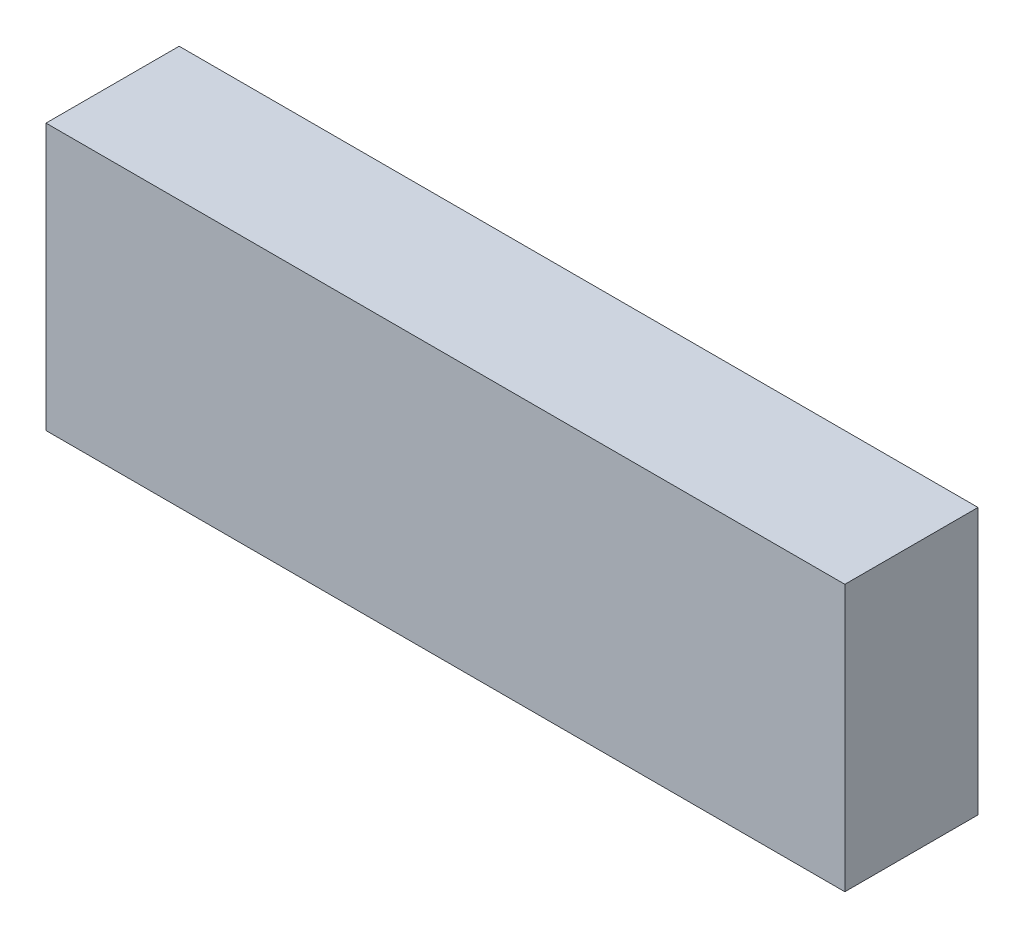
ISO-10303-21;
HEADER;
FILE_DESCRIPTION(('STEP AP214'),'2;1');
FILE_NAME('part.step','',(''),(''),'','','');
FILE_SCHEMA(('AUTOMOTIVE_DESIGN { 1 0 10303 214 1 1 1 1 }'));
ENDSEC;
DATA;
#1=APPLICATION_CONTEXT('core data for automotive mechanical design processes');
#2=APPLICATION_PROTOCOL_DEFINITION('international standard','automotive_design',2000,#1);
#3=PRODUCT_CONTEXT('',#1,'mechanical');
#4=PRODUCT('Part','Part','',(#3));
#5=PRODUCT_RELATED_PRODUCT_CATEGORY('part','',(#4));
#6=PRODUCT_DEFINITION_FORMATION('','',#4);
#7=PRODUCT_DEFINITION_CONTEXT('part definition',#1,'design');
#8=PRODUCT_DEFINITION('design','',#6,#7);
#9=PRODUCT_DEFINITION_SHAPE('','',#8);
#10=(LENGTH_UNIT() NAMED_UNIT(*) SI_UNIT(.MILLI.,.METRE.));
#11=(NAMED_UNIT(*) PLANE_ANGLE_UNIT() SI_UNIT($,.RADIAN.));
#12=(NAMED_UNIT(*) SI_UNIT($,.STERADIAN.) SOLID_ANGLE_UNIT());
#13=UNCERTAINTY_MEASURE_WITH_UNIT(LENGTH_MEASURE(1.E-05),#10,'distance_accuracy_value','');
#14=(GEOMETRIC_REPRESENTATION_CONTEXT(3) GLOBAL_UNCERTAINTY_ASSIGNED_CONTEXT((#13)) GLOBAL_UNIT_ASSIGNED_CONTEXT((#10,
#11,#12)) REPRESENTATION_CONTEXT('',''));
#15=CARTESIAN_POINT('',(0.,0.,0.));
#16=DIRECTION('',(0.,0.,1.));
#17=DIRECTION('',(1.,0.,0.));
#18=AXIS2_PLACEMENT_3D('',#15,#16,#17);
#19=CARTESIAN_POINT('',(1.375,-1.875,0.));
#20=DIRECTION('',(1.,0.,0.));
#21=DIRECTION('',(0.,0.,1.));
#22=AXIS2_PLACEMENT_3D('',#19,#20,#21);
#23=PLANE('',#22);
#24=DIRECTION('',(0.,1.,0.));
#25=VECTOR('',#24,1.);
#26=CARTESIAN_POINT('',(1.375,-1.875,0.1));
#27=LINE('',#26,#25);
#28=CARTESIAN_POINT('',(1.375,-1.875,0.1));
#29=VERTEX_POINT('',#28);
#30=CARTESIAN_POINT('',(1.375,-1.675,0.1));
#31=VERTEX_POINT('',#30);
#32=EDGE_CURVE('E11',#29,#31,#27,.T.);
#33=ORIENTED_EDGE('',*,*,#32,.T.);
#34=DIRECTION('',(0.,0.,1.));
#35=VECTOR('',#34,1.);
#36=CARTESIAN_POINT('',(1.375,-1.675,0.));
#37=LINE('',#36,#35);
#38=CARTESIAN_POINT('',(1.375,-1.675,0.));
#39=VERTEX_POINT('',#38);
#40=EDGE_CURVE('E24',#39,#31,#37,.T.);
#41=ORIENTED_EDGE('',*,*,#40,.F.);
#42=DIRECTION('',(0.,1.,0.));
#43=VECTOR('',#42,1.);
#44=CARTESIAN_POINT('',(1.375,-1.875,0.));
#45=LINE('',#44,#43);
#46=CARTESIAN_POINT('',(1.375,-1.875,0.));
#47=VERTEX_POINT('',#46);
#48=EDGE_CURVE('E86',#47,#39,#45,.T.);
#49=ORIENTED_EDGE('',*,*,#48,.F.);
#50=DIRECTION('',(0.,0.,1.));
#51=VECTOR('',#50,1.);
#52=CARTESIAN_POINT('',(1.375,-1.875,0.));
#53=LINE('',#52,#51);
#54=EDGE_CURVE('E36',#47,#29,#53,.T.);
#55=ORIENTED_EDGE('',*,*,#54,.T.);
#56=EDGE_LOOP('',(#33,#41,#49,#55));
#57=FACE_BOUND('',#56,.T.);
#58=ADVANCED_FACE('F17',(#57),#23,.F.);
#59=CARTESIAN_POINT('',(1.975,-1.875,0.));
#60=DIRECTION('',(1.,0.,0.));
#61=DIRECTION('',(0.,0.,1.));
#62=AXIS2_PLACEMENT_3D('',#59,#60,#61);
#63=PLANE('',#62);
#64=DIRECTION('',(0.,0.,1.));
#65=VECTOR('',#64,1.);
#66=CARTESIAN_POINT('',(1.975,-1.875,0.));
#67=LINE('',#66,#65);
#68=CARTESIAN_POINT('',(1.975,-1.875,0.));
#69=VERTEX_POINT('',#68);
#70=CARTESIAN_POINT('',(1.975,-1.875,0.1));
#71=VERTEX_POINT('',#70);
#72=EDGE_CURVE('E83',#69,#71,#67,.T.);
#73=ORIENTED_EDGE('',*,*,#72,.F.);
#74=DIRECTION('',(0.,1.,0.));
#75=VECTOR('',#74,1.);
#76=CARTESIAN_POINT('',(1.975,-1.875,0.));
#77=LINE('',#76,#75);
#78=CARTESIAN_POINT('',(1.975,-1.675,0.));
#79=VERTEX_POINT('',#78);
#80=EDGE_CURVE('E63',#69,#79,#77,.T.);
#81=ORIENTED_EDGE('',*,*,#80,.T.);
#82=DIRECTION('',(0.,0.,1.));
#83=VECTOR('',#82,1.);
#84=CARTESIAN_POINT('',(1.975,-1.675,0.));
#85=LINE('',#84,#83);
#86=CARTESIAN_POINT('',(1.975,-1.675,0.1));
#87=VERTEX_POINT('',#86);
#88=EDGE_CURVE('E57',#79,#87,#85,.T.);
#89=ORIENTED_EDGE('',*,*,#88,.T.);
#90=DIRECTION('',(0.,1.,0.));
#91=VECTOR('',#90,1.);
#92=CARTESIAN_POINT('',(1.975,-1.875,0.1));
#93=LINE('',#92,#91);
#94=EDGE_CURVE('E60',#71,#87,#93,.T.);
#95=ORIENTED_EDGE('',*,*,#94,.F.);
#96=EDGE_LOOP('',(#73,#81,#89,#95));
#97=FACE_BOUND('',#96,.T.);
#98=ADVANCED_FACE('F59',(#97),#63,.T.);
#99=CARTESIAN_POINT('',(1.375,-1.875,0.));
#100=DIRECTION('',(0.,1.,0.));
#101=DIRECTION('',(0.,0.,1.));
#102=AXIS2_PLACEMENT_3D('',#99,#100,#101);
#103=PLANE('',#102);
#104=ORIENTED_EDGE('',*,*,#72,.T.);
#105=DIRECTION('',(1.,0.,0.));
#106=VECTOR('',#105,1.);
#107=CARTESIAN_POINT('',(1.375,-1.875,0.1));
#108=LINE('',#107,#106);
#109=EDGE_CURVE('E71',#29,#71,#108,.T.);
#110=ORIENTED_EDGE('',*,*,#109,.F.);
#111=ORIENTED_EDGE('',*,*,#54,.F.);
#112=DIRECTION('',(1.,0.,0.));
#113=VECTOR('',#112,1.);
#114=CARTESIAN_POINT('',(1.375,-1.875,0.));
#115=LINE('',#114,#113);
#116=EDGE_CURVE('E76',#47,#69,#115,.T.);
#117=ORIENTED_EDGE('',*,*,#116,.T.);
#118=EDGE_LOOP('',(#104,#110,#111,#117));
#119=FACE_BOUND('',#118,.T.);
#120=ADVANCED_FACE('F91',(#119),#103,.F.);
#121=CARTESIAN_POINT('',(1.375,-1.675,0.));
#122=DIRECTION('',(0.,1.,0.));
#123=DIRECTION('',(0.,0.,1.));
#124=AXIS2_PLACEMENT_3D('',#121,#122,#123);
#125=PLANE('',#124);
#126=DIRECTION('',(1.,0.,0.));
#127=VECTOR('',#126,1.);
#128=CARTESIAN_POINT('',(1.375,-1.675,0.));
#129=LINE('',#128,#127);
#130=EDGE_CURVE('E74',#39,#79,#129,.T.);
#131=ORIENTED_EDGE('',*,*,#130,.F.);
#132=ORIENTED_EDGE('',*,*,#40,.T.);
#133=DIRECTION('',(1.,0.,0.));
#134=VECTOR('',#133,1.);
#135=CARTESIAN_POINT('',(1.375,-1.675,0.1));
#136=LINE('',#135,#134);
#137=EDGE_CURVE('E69',#31,#87,#136,.T.);
#138=ORIENTED_EDGE('',*,*,#137,.T.);
#139=ORIENTED_EDGE('',*,*,#88,.F.);
#140=EDGE_LOOP('',(#131,#132,#138,#139));
#141=FACE_BOUND('',#140,.T.);
#142=ADVANCED_FACE('F73',(#141),#125,.T.);
#143=CARTESIAN_POINT('',(1.375,-1.875,0.));
#144=DIRECTION('',(0.,0.,1.));
#145=DIRECTION('',(1.,0.,0.));
#146=AXIS2_PLACEMENT_3D('',#143,#144,#145);
#147=PLANE('',#146);
#148=ORIENTED_EDGE('',*,*,#130,.T.);
#149=ORIENTED_EDGE('',*,*,#80,.F.);
#150=ORIENTED_EDGE('',*,*,#116,.F.);
#151=ORIENTED_EDGE('',*,*,#48,.T.);
#152=EDGE_LOOP('',(#148,#149,#150,#151));
#153=FACE_BOUND('',#152,.T.);
#154=ADVANCED_FACE('F89',(#153),#147,.F.);
#155=CARTESIAN_POINT('',(1.375,-1.875,0.1));
#156=DIRECTION('',(0.,0.,1.));
#157=DIRECTION('',(1.,0.,0.));
#158=AXIS2_PLACEMENT_3D('',#155,#156,#157);
#159=PLANE('',#158);
#160=ORIENTED_EDGE('',*,*,#32,.F.);
#161=ORIENTED_EDGE('',*,*,#109,.T.);
#162=ORIENTED_EDGE('',*,*,#94,.T.);
#163=ORIENTED_EDGE('',*,*,#137,.F.);
#164=EDGE_LOOP('',(#160,#161,#162,#163));
#165=FACE_BOUND('',#164,.T.);
#166=ADVANCED_FACE('F68',(#165),#159,.T.);
#167=CLOSED_SHELL('',(#58,#98,#120,#142,#154,#166));
#168=MANIFOLD_SOLID_BREP('B1',#167);
#169=ADVANCED_BREP_SHAPE_REPRESENTATION('',(#18,#168),#14);
#170=SHAPE_DEFINITION_REPRESENTATION(#9,#169);
ENDSEC;
END-ISO-10303-21;
